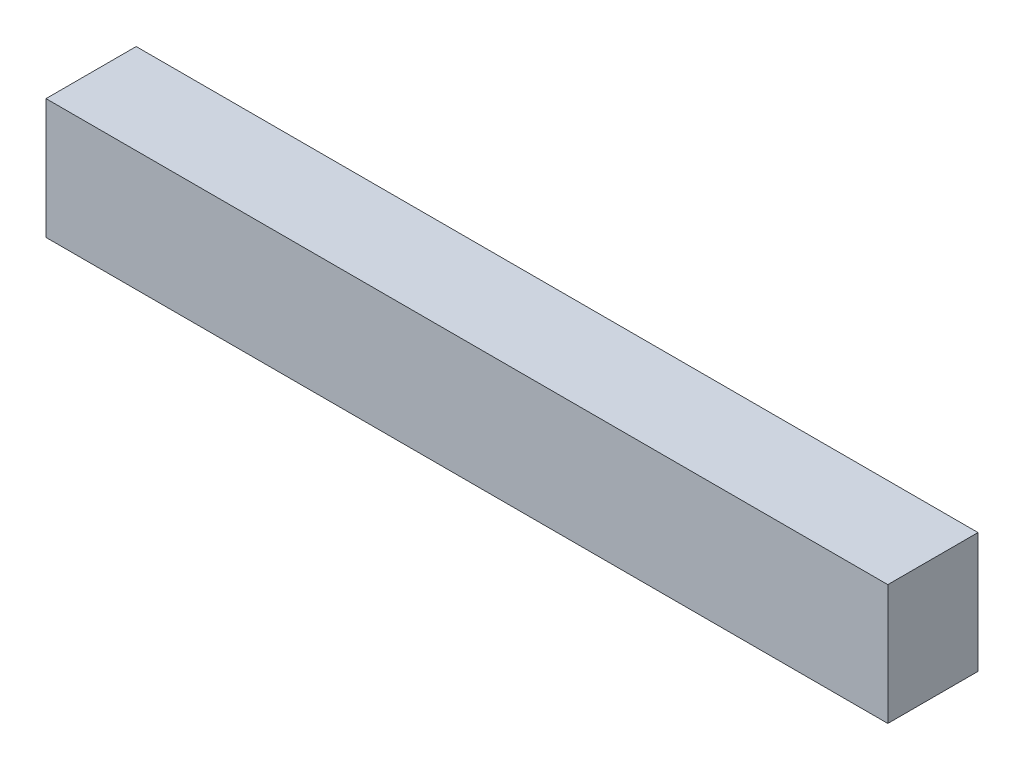
ISO-10303-21;
HEADER;
FILE_DESCRIPTION(('STEP AP214'),'2;1');
FILE_NAME('part.step','',(''),(''),'','','');
FILE_SCHEMA(('AUTOMOTIVE_DESIGN { 1 0 10303 214 1 1 1 1 }'));
ENDSEC;
DATA;
#1=APPLICATION_CONTEXT('core data for automotive mechanical design processes');
#2=APPLICATION_PROTOCOL_DEFINITION('international standard','automotive_design',2000,#1);
#3=PRODUCT_CONTEXT('',#1,'mechanical');
#4=PRODUCT('Part','Part','',(#3));
#5=PRODUCT_RELATED_PRODUCT_CATEGORY('part','',(#4));
#6=PRODUCT_DEFINITION_FORMATION('','',#4);
#7=PRODUCT_DEFINITION_CONTEXT('part definition',#1,'design');
#8=PRODUCT_DEFINITION('design','',#6,#7);
#9=PRODUCT_DEFINITION_SHAPE('','',#8);
#10=(LENGTH_UNIT() NAMED_UNIT(*) SI_UNIT(.MILLI.,.METRE.));
#11=(NAMED_UNIT(*) PLANE_ANGLE_UNIT() SI_UNIT($,.RADIAN.));
#12=(NAMED_UNIT(*) SI_UNIT($,.STERADIAN.) SOLID_ANGLE_UNIT());
#13=UNCERTAINTY_MEASURE_WITH_UNIT(LENGTH_MEASURE(1.E-05),#10,'distance_accuracy_value','');
#14=(GEOMETRIC_REPRESENTATION_CONTEXT(3) GLOBAL_UNCERTAINTY_ASSIGNED_CONTEXT((#13)) GLOBAL_UNIT_ASSIGNED_CONTEXT((#10,
#11,#12)) REPRESENTATION_CONTEXT('',''));
#15=CARTESIAN_POINT('',(0.,0.,0.));
#16=DIRECTION('',(0.,0.,1.));
#17=DIRECTION('',(1.,0.,0.));
#18=AXIS2_PLACEMENT_3D('',#15,#16,#17);
#19=CARTESIAN_POINT('',(-60.8405481941615,-21.5548398331563,3.));
#20=DIRECTION('',(1.,0.,0.));
#21=DIRECTION('',(0.,0.,-1.));
#22=AXIS2_PLACEMENT_3D('',#19,#20,#21);
#23=PLANE('',#22);
#24=DIRECTION('',(0.,-1.,0.));
#25=VECTOR('',#24,1.);
#26=CARTESIAN_POINT('',(-60.8405481941615,-21.5548398331563,0.));
#27=LINE('',#26,#25);
#28=CARTESIAN_POINT('',(-60.8405481941615,-17.5548398331563,0.));
#29=VERTEX_POINT('',#28);
#30=CARTESIAN_POINT('',(-60.8405481941615,-21.5548398331563,0.));
#31=VERTEX_POINT('',#30);
#32=EDGE_CURVE('E98',#29,#31,#27,.T.);
#33=ORIENTED_EDGE('',*,*,#32,.T.);
#34=DIRECTION('',(0.,0.,-1.));
#35=VECTOR('',#34,1.);
#36=CARTESIAN_POINT('',(-60.8405481941615,-21.5548398331563,3.));
#37=LINE('',#36,#35);
#38=CARTESIAN_POINT('',(-60.8405481941615,-21.5548398331563,3.));
#39=VERTEX_POINT('',#38);
#40=EDGE_CURVE('E11',#39,#31,#37,.T.);
#41=ORIENTED_EDGE('',*,*,#40,.F.);
#42=DIRECTION('',(0.,-1.,0.));
#43=VECTOR('',#42,1.);
#44=CARTESIAN_POINT('',(-60.8405481941615,-21.5548398331563,3.));
#45=LINE('',#44,#43);
#46=CARTESIAN_POINT('',(-60.8405481941615,-17.5548398331563,3.));
#47=VERTEX_POINT('',#46);
#48=EDGE_CURVE('E86',#47,#39,#45,.T.);
#49=ORIENTED_EDGE('',*,*,#48,.F.);
#50=DIRECTION('',(0.,0.,-1.));
#51=VECTOR('',#50,1.);
#52=CARTESIAN_POINT('',(-60.8405481941615,-17.5548398331563,3.));
#53=LINE('',#52,#51);
#54=EDGE_CURVE('E94',#47,#29,#53,.T.);
#55=ORIENTED_EDGE('',*,*,#54,.T.);
#56=EDGE_LOOP('',(#33,#41,#49,#55));
#57=FACE_BOUND('',#56,.T.);
#58=ADVANCED_FACE('F35',(#57),#23,.F.);
#59=CARTESIAN_POINT('',(-60.8405481941615,-21.5548398331563,3.));
#60=DIRECTION('',(0.,1.,0.));
#61=DIRECTION('',(0.,0.,1.));
#62=AXIS2_PLACEMENT_3D('',#59,#60,#61);
#63=PLANE('',#62);
#64=DIRECTION('',(1.,0.,0.));
#65=VECTOR('',#64,1.);
#66=CARTESIAN_POINT('',(-60.8405481941615,-21.5548398331563,0.));
#67=LINE('',#66,#65);
#68=CARTESIAN_POINT('',(-32.8405481941615,-21.5548398331563,0.));
#69=VERTEX_POINT('',#68);
#70=EDGE_CURVE('E90',#31,#69,#67,.T.);
#71=ORIENTED_EDGE('',*,*,#70,.T.);
#72=DIRECTION('',(0.,0.,-1.));
#73=VECTOR('',#72,1.);
#74=CARTESIAN_POINT('',(-32.8405481941615,-21.5548398331563,3.));
#75=LINE('',#74,#73);
#76=CARTESIAN_POINT('',(-32.8405481941615,-21.5548398331563,3.));
#77=VERTEX_POINT('',#76);
#78=EDGE_CURVE('E43',#77,#69,#75,.T.);
#79=ORIENTED_EDGE('',*,*,#78,.F.);
#80=DIRECTION('',(1.,0.,0.));
#81=VECTOR('',#80,1.);
#82=CARTESIAN_POINT('',(-60.8405481941615,-21.5548398331563,3.));
#83=LINE('',#82,#81);
#84=EDGE_CURVE('E81',#39,#77,#83,.T.);
#85=ORIENTED_EDGE('',*,*,#84,.F.);
#86=ORIENTED_EDGE('',*,*,#40,.T.);
#87=EDGE_LOOP('',(#71,#79,#85,#86));
#88=FACE_BOUND('',#87,.T.);
#89=ADVANCED_FACE('F89',(#88),#63,.F.);
#90=CARTESIAN_POINT('',(-32.8405481941615,-21.5548398331563,3.));
#91=DIRECTION('',(-1.,0.,0.));
#92=DIRECTION('',(0.,-1.,0.));
#93=AXIS2_PLACEMENT_3D('',#90,#91,#92);
#94=PLANE('',#93);
#95=DIRECTION('',(0.,1.,0.));
#96=VECTOR('',#95,1.);
#97=CARTESIAN_POINT('',(-32.8405481941615,-21.5548398331563,0.));
#98=LINE('',#97,#96);
#99=CARTESIAN_POINT('',(-32.8405481941615,-17.5548398331563,0.));
#100=VERTEX_POINT('',#99);
#101=EDGE_CURVE('E68',#69,#100,#98,.T.);
#102=ORIENTED_EDGE('',*,*,#101,.T.);
#103=DIRECTION('',(0.,0.,-1.));
#104=VECTOR('',#103,1.);
#105=CARTESIAN_POINT('',(-32.8405481941615,-17.5548398331563,3.));
#106=LINE('',#105,#104);
#107=CARTESIAN_POINT('',(-32.8405481941615,-17.5548398331563,3.));
#108=VERTEX_POINT('',#107);
#109=EDGE_CURVE('E91',#108,#100,#106,.T.);
#110=ORIENTED_EDGE('',*,*,#109,.F.);
#111=DIRECTION('',(0.,1.,0.));
#112=VECTOR('',#111,1.);
#113=CARTESIAN_POINT('',(-32.8405481941615,-21.5548398331563,3.));
#114=LINE('',#113,#112);
#115=EDGE_CURVE('E84',#77,#108,#114,.T.);
#116=ORIENTED_EDGE('',*,*,#115,.F.);
#117=ORIENTED_EDGE('',*,*,#78,.T.);
#118=EDGE_LOOP('',(#102,#110,#116,#117));
#119=FACE_BOUND('',#118,.T.);
#120=ADVANCED_FACE('F92',(#119),#94,.F.);
#121=CARTESIAN_POINT('',(-60.8405481941615,-17.5548398331563,3.));
#122=DIRECTION('',(0.,-1.,0.));
#123=DIRECTION('',(0.,0.,-1.));
#124=AXIS2_PLACEMENT_3D('',#121,#122,#123);
#125=PLANE('',#124);
#126=DIRECTION('',(-1.,0.,0.));
#127=VECTOR('',#126,1.);
#128=CARTESIAN_POINT('',(-60.8405481941615,-17.5548398331563,0.));
#129=LINE('',#128,#127);
#130=EDGE_CURVE('E74',#100,#29,#129,.T.);
#131=ORIENTED_EDGE('',*,*,#130,.T.);
#132=ORIENTED_EDGE('',*,*,#54,.F.);
#133=DIRECTION('',(-1.,0.,0.));
#134=VECTOR('',#133,1.);
#135=CARTESIAN_POINT('',(-60.8405481941615,-17.5548398331563,3.));
#136=LINE('',#135,#134);
#137=EDGE_CURVE('E51',#108,#47,#136,.T.);
#138=ORIENTED_EDGE('',*,*,#137,.F.);
#139=ORIENTED_EDGE('',*,*,#109,.T.);
#140=EDGE_LOOP('',(#131,#132,#138,#139));
#141=FACE_BOUND('',#140,.T.);
#142=ADVANCED_FACE('F105',(#141),#125,.F.);
#143=CARTESIAN_POINT('',(0.,0.,3.));
#144=DIRECTION('',(0.,0.,-1.));
#145=DIRECTION('',(-1.,0.,0.));
#146=AXIS2_PLACEMENT_3D('',#143,#144,#145);
#147=PLANE('',#146);
#148=ORIENTED_EDGE('',*,*,#48,.T.);
#149=ORIENTED_EDGE('',*,*,#84,.T.);
#150=ORIENTED_EDGE('',*,*,#115,.T.);
#151=ORIENTED_EDGE('',*,*,#137,.T.);
#152=EDGE_LOOP('',(#148,#149,#150,#151));
#153=FACE_BOUND('',#152,.T.);
#154=ADVANCED_FACE('F82',(#153),#147,.F.);
#155=CARTESIAN_POINT('',(0.,0.,0.));
#156=DIRECTION('',(0.,0.,-1.));
#157=DIRECTION('',(-1.,0.,0.));
#158=AXIS2_PLACEMENT_3D('',#155,#156,#157);
#159=PLANE('',#158);
#160=ORIENTED_EDGE('',*,*,#32,.F.);
#161=ORIENTED_EDGE('',*,*,#130,.F.);
#162=ORIENTED_EDGE('',*,*,#101,.F.);
#163=ORIENTED_EDGE('',*,*,#70,.F.);
#164=EDGE_LOOP('',(#160,#161,#162,#163));
#165=FACE_BOUND('',#164,.T.);
#166=ADVANCED_FACE('F108',(#165),#159,.T.);
#167=CLOSED_SHELL('',(#58,#89,#120,#142,#154,#166));
#168=MANIFOLD_SOLID_BREP('B2',#167);
#169=ADVANCED_BREP_SHAPE_REPRESENTATION('',(#18,#168),#14);
#170=SHAPE_DEFINITION_REPRESENTATION(#9,#169);
ENDSEC;
END-ISO-10303-21;
